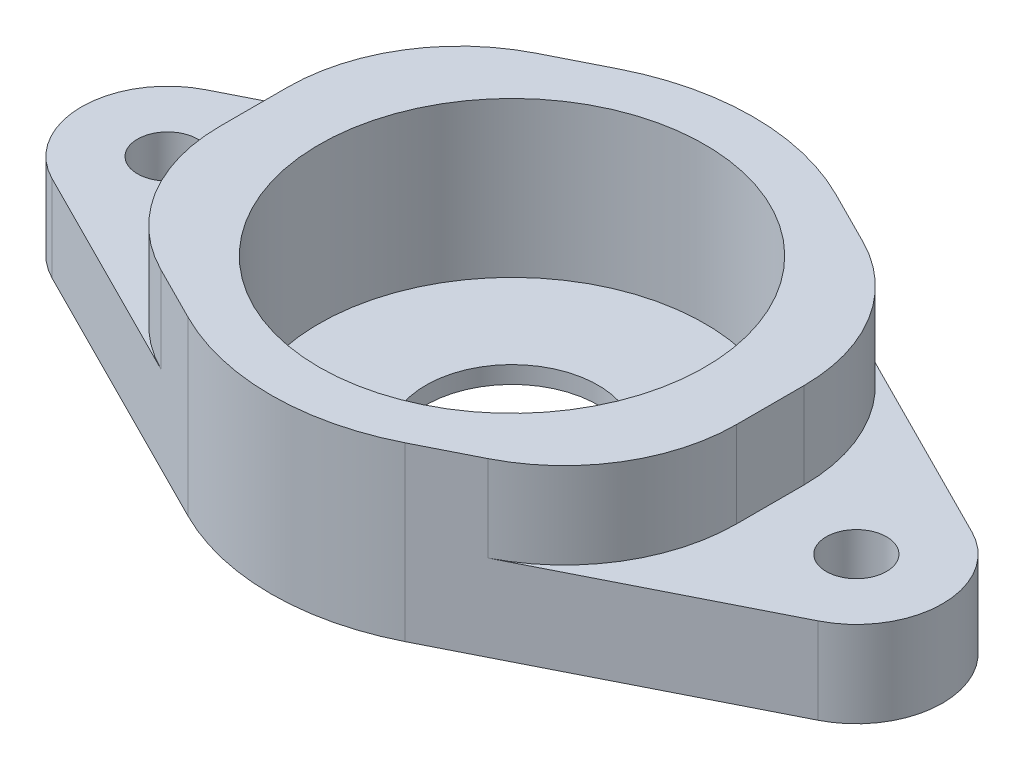
ISO-10303-21;
HEADER;
FILE_DESCRIPTION(('STEP AP214'),'2;1');
FILE_NAME('part.step','',(''),(''),'','','');
FILE_SCHEMA(('AUTOMOTIVE_DESIGN { 1 0 10303 214 1 1 1 1 }'));
ENDSEC;
DATA;
#1=APPLICATION_CONTEXT('core data for automotive mechanical design processes');
#2=APPLICATION_PROTOCOL_DEFINITION('international standard','automotive_design',2000,#1);
#3=PRODUCT_CONTEXT('',#1,'mechanical');
#4=PRODUCT('Part','Part','',(#3));
#5=PRODUCT_RELATED_PRODUCT_CATEGORY('part','',(#4));
#6=PRODUCT_DEFINITION_FORMATION('','',#4);
#7=PRODUCT_DEFINITION_CONTEXT('part definition',#1,'design');
#8=PRODUCT_DEFINITION('design','',#6,#7);
#9=PRODUCT_DEFINITION_SHAPE('','',#8);
#10=(LENGTH_UNIT() NAMED_UNIT(*) SI_UNIT(.MILLI.,.METRE.));
#11=(NAMED_UNIT(*) PLANE_ANGLE_UNIT() SI_UNIT($,.RADIAN.));
#12=(NAMED_UNIT(*) SI_UNIT($,.STERADIAN.) SOLID_ANGLE_UNIT());
#13=UNCERTAINTY_MEASURE_WITH_UNIT(LENGTH_MEASURE(1.E-05),#10,'distance_accuracy_value','');
#14=(GEOMETRIC_REPRESENTATION_CONTEXT(3) GLOBAL_UNCERTAINTY_ASSIGNED_CONTEXT((#13)) GLOBAL_UNIT_ASSIGNED_CONTEXT((#10,
#11,#12)) REPRESENTATION_CONTEXT('',''));
#15=CARTESIAN_POINT('',(0.,0.,0.));
#16=DIRECTION('',(0.,0.,1.));
#17=DIRECTION('',(1.,0.,0.));
#18=AXIS2_PLACEMENT_3D('',#15,#16,#17);
#19=CARTESIAN_POINT('',(-20.,10.,0.));
#20=DIRECTION('',(0.,1.,0.));
#21=DIRECTION('',(0.,0.,1.));
#22=AXIS2_PLACEMENT_3D('',#19,#20,#21);
#23=PLANE('',#22);
#24=DIRECTION('',(0.893028554974588,0.,-0.45));
#25=VECTOR('',#24,1.);
#26=CARTESIAN_POINT('',(6.3,10.,12.5023997696442));
#27=LINE('',#26,#25);
#28=CARTESIAN_POINT('',(6.3,10.,12.5023997696442));
#29=VERTEX_POINT('',#28);
#30=CARTESIAN_POINT('',(9.49999999999999,10.,10.8899093380914));
#31=VERTEX_POINT('',#30);
#32=EDGE_CURVE('E259',#29,#31,#27,.T.);
#33=ORIENTED_EDGE('',*,*,#32,.T.);
#34=CARTESIAN_POINT('',(4.99999999999999,10.,1.95962378834549));
#35=DIRECTION('',(0.,1.,0.));
#36=DIRECTION('',(0.,0.,1.));
#37=AXIS2_PLACEMENT_3D('',#34,#35,#36);
#38=CIRCLE('',#37,10.);
#39=CARTESIAN_POINT('',(15.,10.,1.95962378834549));
#40=VERTEX_POINT('',#39);
#41=EDGE_CURVE('E207',#31,#40,#38,.T.);
#42=ORIENTED_EDGE('',*,*,#41,.T.);
#43=DIRECTION('',(0.,0.,1.));
#44=VECTOR('',#43,1.);
#45=CARTESIAN_POINT('',(15.,10.,-14.));
#46=LINE('',#45,#44);
#47=CARTESIAN_POINT('',(15.,10.,-1.95962378834549));
#48=VERTEX_POINT('',#47);
#49=EDGE_CURVE('E246',#48,#40,#46,.T.);
#50=ORIENTED_EDGE('',*,*,#49,.F.);
#51=CARTESIAN_POINT('',(4.99999999999999,10.,-1.95962378834549));
#52=DIRECTION('',(0.,1.,0.));
#53=DIRECTION('',(0.,0.,1.));
#54=AXIS2_PLACEMENT_3D('',#51,#52,#53);
#55=CIRCLE('',#54,10.);
#56=CARTESIAN_POINT('',(9.49999999999999,10.,-10.8899093380914));
#57=VERTEX_POINT('',#56);
#58=EDGE_CURVE('E205',#48,#57,#55,.T.);
#59=ORIENTED_EDGE('',*,*,#58,.T.);
#60=DIRECTION('',(-0.893028554974588,0.,-0.45));
#61=VECTOR('',#60,1.);
#62=CARTESIAN_POINT('',(6.3,10.,-12.5023997696442));
#63=LINE('',#62,#61);
#64=CARTESIAN_POINT('',(6.3,10.,-12.5023997696442));
#65=VERTEX_POINT('',#64);
#66=EDGE_CURVE('E254',#57,#65,#63,.T.);
#67=ORIENTED_EDGE('',*,*,#66,.T.);
#68=CARTESIAN_POINT('',(0.,10.,0.));
#69=DIRECTION('',(0.,1.,0.));
#70=DIRECTION('',(0.,0.,1.));
#71=AXIS2_PLACEMENT_3D('',#68,#69,#70);
#72=CIRCLE('',#71,14.);
#73=CARTESIAN_POINT('',(-6.3,10.,-12.5023997696442));
#74=VERTEX_POINT('',#73);
#75=EDGE_CURVE('E173',#65,#74,#72,.T.);
#76=ORIENTED_EDGE('',*,*,#75,.T.);
#77=DIRECTION('',(-0.893028554974588,0.,0.45));
#78=VECTOR('',#77,1.);
#79=CARTESIAN_POINT('',(-22.25,10.,-4.46514277487293));
#80=LINE('',#79,#78);
#81=CARTESIAN_POINT('',(-9.5,10.,-10.8899093380914));
#82=VERTEX_POINT('',#81);
#83=EDGE_CURVE('E168',#74,#82,#80,.T.);
#84=ORIENTED_EDGE('',*,*,#83,.T.);
#85=CARTESIAN_POINT('',(-5.,10.,-1.95962378834549));
#86=DIRECTION('',(0.,1.,0.));
#87=DIRECTION('',(0.,0.,1.));
#88=AXIS2_PLACEMENT_3D('',#85,#86,#87);
#89=CIRCLE('',#88,10.);
#90=CARTESIAN_POINT('',(-15.,10.,-1.95962378834549));
#91=VERTEX_POINT('',#90);
#92=EDGE_CURVE('E203',#82,#91,#89,.T.);
#93=ORIENTED_EDGE('',*,*,#92,.T.);
#94=DIRECTION('',(0.,0.,1.));
#95=VECTOR('',#94,1.);
#96=CARTESIAN_POINT('',(-15.,10.,-14.));
#97=LINE('',#96,#95);
#98=CARTESIAN_POINT('',(-15.,10.,1.95962378834549));
#99=VERTEX_POINT('',#98);
#100=EDGE_CURVE('E308',#91,#99,#97,.T.);
#101=ORIENTED_EDGE('',*,*,#100,.T.);
#102=CARTESIAN_POINT('',(-5.,10.,1.95962378834549));
#103=DIRECTION('',(0.,1.,0.));
#104=DIRECTION('',(0.,0.,1.));
#105=AXIS2_PLACEMENT_3D('',#102,#103,#104);
#106=CIRCLE('',#105,10.);
#107=CARTESIAN_POINT('',(-9.5,10.,10.8899093380914));
#108=VERTEX_POINT('',#107);
#109=EDGE_CURVE('E201',#99,#108,#106,.T.);
#110=ORIENTED_EDGE('',*,*,#109,.T.);
#111=DIRECTION('',(0.893028554974588,0.,0.45));
#112=VECTOR('',#111,1.);
#113=CARTESIAN_POINT('',(-22.25,10.,4.46514277487294));
#114=LINE('',#113,#112);
#115=CARTESIAN_POINT('',(-6.3,10.,12.5023997696442));
#116=VERTEX_POINT('',#115);
#117=EDGE_CURVE('E284',#108,#116,#114,.T.);
#118=ORIENTED_EDGE('',*,*,#117,.T.);
#119=CARTESIAN_POINT('',(0.,10.,0.));
#120=DIRECTION('',(0.,1.,0.));
#121=DIRECTION('',(0.,0.,1.));
#122=AXIS2_PLACEMENT_3D('',#119,#120,#121);
#123=CIRCLE('',#122,14.);
#124=EDGE_CURVE('E262',#116,#29,#123,.T.);
#125=ORIENTED_EDGE('',*,*,#124,.T.);
#126=EDGE_LOOP('',(#33,#42,#50,#59,#67,#76,#84,#93,#101,#110,#118,#125));
#127=FACE_BOUND('',#126,.T.);
#128=CARTESIAN_POINT('',(0.,10.,0.));
#129=DIRECTION('',(0.,1.,0.));
#130=DIRECTION('',(0.,0.,1.));
#131=AXIS2_PLACEMENT_3D('',#128,#129,#130);
#132=CIRCLE('',#131,11.2);
#133=CARTESIAN_POINT('',(0.,10.,11.2));
#134=VERTEX_POINT('',#133);
#135=EDGE_CURVE('E295',#134,#134,#132,.T.);
#136=ORIENTED_EDGE('',*,*,#135,.F.);
#137=EDGE_LOOP('',(#136));
#138=FACE_BOUND('',#137,.T.);
#139=ADVANCED_FACE('F34',(#127,#138),#23,.T.);
#140=CARTESIAN_POINT('',(-20.,0.,0.));
#141=DIRECTION('',(0.,1.,0.));
#142=DIRECTION('',(0.,0.,1.));
#143=AXIS2_PLACEMENT_3D('',#140,#141,#142);
#144=PLANE('',#143);
#145=CARTESIAN_POINT('',(0.,0.,0.));
#146=DIRECTION('',(0.,1.,0.));
#147=DIRECTION('',(0.,0.,1.));
#148=AXIS2_PLACEMENT_3D('',#145,#146,#147);
#149=CIRCLE('',#148,5.);
#150=CARTESIAN_POINT('',(0.,0.,5.));
#151=VERTEX_POINT('',#150);
#152=EDGE_CURVE('E312',#151,#151,#149,.T.);
#153=ORIENTED_EDGE('',*,*,#152,.T.);
#154=EDGE_LOOP('',(#153));
#155=FACE_BOUND('',#154,.T.);
#156=CARTESIAN_POINT('',(-20.,0.,0.));
#157=DIRECTION('',(0.,1.,0.));
#158=DIRECTION('',(0.,0.,1.));
#159=AXIS2_PLACEMENT_3D('',#156,#157,#158);
#160=CIRCLE('',#159,5.);
#161=CARTESIAN_POINT('',(-22.25,0.,-4.46514277487293));
#162=VERTEX_POINT('',#161);
#163=CARTESIAN_POINT('',(-22.25,0.,4.46514277487294));
#164=VERTEX_POINT('',#163);
#165=EDGE_CURVE('E266',#162,#164,#160,.T.);
#166=ORIENTED_EDGE('',*,*,#165,.F.);
#167=DIRECTION('',(-0.893028554974588,0.,0.45));
#168=VECTOR('',#167,1.);
#169=CARTESIAN_POINT('',(-22.25,0.,-4.46514277487293));
#170=LINE('',#169,#168);
#171=CARTESIAN_POINT('',(-6.3,0.,-12.5023997696442));
#172=VERTEX_POINT('',#171);
#173=EDGE_CURVE('E165',#172,#162,#170,.T.);
#174=ORIENTED_EDGE('',*,*,#173,.F.);
#175=CARTESIAN_POINT('',(0.,0.,0.));
#176=DIRECTION('',(0.,1.,0.));
#177=DIRECTION('',(0.,0.,1.));
#178=AXIS2_PLACEMENT_3D('',#175,#176,#177);
#179=CIRCLE('',#178,14.);
#180=CARTESIAN_POINT('',(6.3,0.,-12.5023997696442));
#181=VERTEX_POINT('',#180);
#182=EDGE_CURVE('E280',#181,#172,#179,.T.);
#183=ORIENTED_EDGE('',*,*,#182,.F.);
#184=DIRECTION('',(-0.893028554974588,0.,-0.45));
#185=VECTOR('',#184,1.);
#186=CARTESIAN_POINT('',(6.3,0.,-12.5023997696442));
#187=LINE('',#186,#185);
#188=CARTESIAN_POINT('',(22.25,0.,-4.46514277487293));
#189=VERTEX_POINT('',#188);
#190=EDGE_CURVE('E279',#189,#181,#187,.T.);
#191=ORIENTED_EDGE('',*,*,#190,.F.);
#192=CARTESIAN_POINT('',(20.,0.,0.));
#193=DIRECTION('',(0.,1.,0.));
#194=DIRECTION('',(0.,0.,1.));
#195=AXIS2_PLACEMENT_3D('',#192,#193,#194);
#196=CIRCLE('',#195,5.);
#197=CARTESIAN_POINT('',(22.25,0.,4.46514277487293));
#198=VERTEX_POINT('',#197);
#199=EDGE_CURVE('E276',#198,#189,#196,.T.);
#200=ORIENTED_EDGE('',*,*,#199,.F.);
#201=DIRECTION('',(0.893028554974588,0.,-0.45));
#202=VECTOR('',#201,1.);
#203=CARTESIAN_POINT('',(6.3,0.,12.5023997696442));
#204=LINE('',#203,#202);
#205=CARTESIAN_POINT('',(6.3,0.,12.5023997696442));
#206=VERTEX_POINT('',#205);
#207=EDGE_CURVE('E273',#206,#198,#204,.T.);
#208=ORIENTED_EDGE('',*,*,#207,.F.);
#209=CARTESIAN_POINT('',(0.,0.,0.));
#210=DIRECTION('',(0.,1.,0.));
#211=DIRECTION('',(0.,0.,1.));
#212=AXIS2_PLACEMENT_3D('',#209,#210,#211);
#213=CIRCLE('',#212,14.);
#214=CARTESIAN_POINT('',(-6.3,0.,12.5023997696442));
#215=VERTEX_POINT('',#214);
#216=EDGE_CURVE('E271',#215,#206,#213,.T.);
#217=ORIENTED_EDGE('',*,*,#216,.F.);
#218=DIRECTION('',(0.893028554974588,0.,0.45));
#219=VECTOR('',#218,1.);
#220=CARTESIAN_POINT('',(-22.25,0.,4.46514277487294));
#221=LINE('',#220,#219);
#222=EDGE_CURVE('E268',#164,#215,#221,.T.);
#223=ORIENTED_EDGE('',*,*,#222,.F.);
#224=EDGE_LOOP('',(#166,#174,#183,#191,#200,#208,#217,#223));
#225=FACE_BOUND('',#224,.T.);
#226=CARTESIAN_POINT('',(20.,0.,0.));
#227=DIRECTION('',(0.,1.,0.));
#228=DIRECTION('',(0.,0.,1.));
#229=AXIS2_PLACEMENT_3D('',#226,#227,#228);
#230=CIRCLE('',#229,1.75);
#231=CARTESIAN_POINT('',(20.,0.,1.75));
#232=VERTEX_POINT('',#231);
#233=EDGE_CURVE('E269',#232,#232,#230,.T.);
#234=ORIENTED_EDGE('',*,*,#233,.T.);
#235=EDGE_LOOP('',(#234));
#236=FACE_BOUND('',#235,.T.);
#237=CARTESIAN_POINT('',(-20.,0.,0.));
#238=DIRECTION('',(0.,1.,0.));
#239=DIRECTION('',(0.,0.,1.));
#240=AXIS2_PLACEMENT_3D('',#237,#238,#239);
#241=CIRCLE('',#240,1.75);
#242=CARTESIAN_POINT('',(-20.,0.,1.75));
#243=VERTEX_POINT('',#242);
#244=EDGE_CURVE('E291',#243,#243,#241,.T.);
#245=ORIENTED_EDGE('',*,*,#244,.T.);
#246=EDGE_LOOP('',(#245));
#247=FACE_BOUND('',#246,.T.);
#248=ADVANCED_FACE('F336',(#155,#225,#236,#247),#144,.F.);
#249=CARTESIAN_POINT('',(-20.,10.,0.));
#250=DIRECTION('',(0.,-1.,0.));
#251=DIRECTION('',(0.,0.,-1.));
#252=AXIS2_PLACEMENT_3D('',#249,#250,#251);
#253=CYLINDRICAL_SURFACE('',#252,5.);
#254=DIRECTION('',(0.,-1.,0.));
#255=VECTOR('',#254,1.);
#256=CARTESIAN_POINT('',(-22.25,10.,4.46514277487294));
#257=LINE('',#256,#255);
#258=CARTESIAN_POINT('',(-22.25,5.,4.46514277487294));
#259=VERTEX_POINT('',#258);
#260=EDGE_CURVE('E151',#259,#164,#257,.T.);
#261=ORIENTED_EDGE('',*,*,#260,.F.);
#262=CARTESIAN_POINT('',(-20.,5.,0.));
#263=DIRECTION('',(0.,-1.,0.));
#264=DIRECTION('',(1.,0.,0.));
#265=AXIS2_PLACEMENT_3D('',#262,#263,#264);
#266=CIRCLE('',#265,5.);
#267=CARTESIAN_POINT('',(-22.25,5.,-4.46514277487293));
#268=VERTEX_POINT('',#267);
#269=EDGE_CURVE('E144',#259,#268,#266,.T.);
#270=ORIENTED_EDGE('',*,*,#269,.T.);
#271=DIRECTION('',(0.,-1.,0.));
#272=VECTOR('',#271,1.);
#273=CARTESIAN_POINT('',(-22.25,10.,-4.46514277487293));
#274=LINE('',#273,#272);
#275=EDGE_CURVE('E149',#268,#162,#274,.T.);
#276=ORIENTED_EDGE('',*,*,#275,.T.);
#277=ORIENTED_EDGE('',*,*,#165,.T.);
#278=EDGE_LOOP('',(#261,#270,#276,#277));
#279=FACE_BOUND('',#278,.T.);
#280=ADVANCED_FACE('F146',(#279),#253,.T.);
#281=CARTESIAN_POINT('',(-22.25,10.,4.46514277487294));
#282=DIRECTION('',(0.45,0.,-0.893028554974588));
#283=DIRECTION('',(-0.893028554974588,0.,-0.45));
#284=AXIS2_PLACEMENT_3D('',#281,#282,#283);
#285=PLANE('',#284);
#286=ORIENTED_EDGE('',*,*,#117,.F.);
#287=DIRECTION('',(0.,-1.,0.));
#288=VECTOR('',#287,1.);
#289=CARTESIAN_POINT('',(-9.5,10.,10.8899093380914));
#290=LINE('',#289,#288);
#291=CARTESIAN_POINT('',(-9.49999999999999,5.,10.8899093380914));
#292=VERTEX_POINT('',#291);
#293=EDGE_CURVE('E222',#108,#292,#290,.T.);
#294=ORIENTED_EDGE('',*,*,#293,.T.);
#295=DIRECTION('',(-0.893028554974588,0.,-0.45));
#296=VECTOR('',#295,1.);
#297=CARTESIAN_POINT('',(-22.25,5.,4.46514277487294));
#298=LINE('',#297,#296);
#299=EDGE_CURVE('E49',#292,#259,#298,.T.);
#300=ORIENTED_EDGE('',*,*,#299,.T.);
#301=ORIENTED_EDGE('',*,*,#260,.T.);
#302=ORIENTED_EDGE('',*,*,#222,.T.);
#303=DIRECTION('',(0.,-1.,0.));
#304=VECTOR('',#303,1.);
#305=CARTESIAN_POINT('',(-6.3,10.,12.5023997696442));
#306=LINE('',#305,#304);
#307=EDGE_CURVE('E187',#116,#215,#306,.T.);
#308=ORIENTED_EDGE('',*,*,#307,.F.);
#309=EDGE_LOOP('',(#286,#294,#300,#301,#302,#308));
#310=FACE_BOUND('',#309,.T.);
#311=ADVANCED_FACE('F364',(#310),#285,.F.);
#312=CARTESIAN_POINT('',(0.,10.,0.));
#313=DIRECTION('',(0.,-1.,0.));
#314=DIRECTION('',(0.,0.,-1.));
#315=AXIS2_PLACEMENT_3D('',#312,#313,#314);
#316=CYLINDRICAL_SURFACE('',#315,14.);
#317=ORIENTED_EDGE('',*,*,#216,.T.);
#318=DIRECTION('',(0.,-1.,0.));
#319=VECTOR('',#318,1.);
#320=CARTESIAN_POINT('',(6.3,10.,12.5023997696442));
#321=LINE('',#320,#319);
#322=EDGE_CURVE('E184',#29,#206,#321,.T.);
#323=ORIENTED_EDGE('',*,*,#322,.F.);
#324=ORIENTED_EDGE('',*,*,#124,.F.);
#325=ORIENTED_EDGE('',*,*,#307,.T.);
#326=EDGE_LOOP('',(#317,#323,#324,#325));
#327=FACE_BOUND('',#326,.T.);
#328=ADVANCED_FACE('F360',(#327),#316,.T.);
#329=CARTESIAN_POINT('',(6.3,10.,12.5023997696442));
#330=DIRECTION('',(-0.45,0.,-0.893028554974588));
#331=DIRECTION('',(-0.893028554974588,0.,0.45));
#332=AXIS2_PLACEMENT_3D('',#329,#330,#331);
#333=PLANE('',#332);
#334=DIRECTION('',(-0.893028554974588,0.,0.45));
#335=VECTOR('',#334,1.);
#336=CARTESIAN_POINT('',(6.3,5.,12.5023997696442));
#337=LINE('',#336,#335);
#338=CARTESIAN_POINT('',(22.25,5.,4.46514277487293));
#339=VERTEX_POINT('',#338);
#340=CARTESIAN_POINT('',(9.49999999999999,5.,10.8899093380914));
#341=VERTEX_POINT('',#340);
#342=EDGE_CURVE('E298',#339,#341,#337,.T.);
#343=ORIENTED_EDGE('',*,*,#342,.T.);
#344=DIRECTION('',(0.,1.,0.));
#345=VECTOR('',#344,1.);
#346=CARTESIAN_POINT('',(9.49999999999999,10.,10.8899093380914));
#347=LINE('',#346,#345);
#348=EDGE_CURVE('E191',#341,#31,#347,.T.);
#349=ORIENTED_EDGE('',*,*,#348,.T.);
#350=ORIENTED_EDGE('',*,*,#32,.F.);
#351=ORIENTED_EDGE('',*,*,#322,.T.);
#352=ORIENTED_EDGE('',*,*,#207,.T.);
#353=DIRECTION('',(0.,-1.,0.));
#354=VECTOR('',#353,1.);
#355=CARTESIAN_POINT('',(22.25,10.,4.46514277487293));
#356=LINE('',#355,#354);
#357=EDGE_CURVE('E182',#339,#198,#356,.T.);
#358=ORIENTED_EDGE('',*,*,#357,.F.);
#359=EDGE_LOOP('',(#343,#349,#350,#351,#352,#358));
#360=FACE_BOUND('',#359,.T.);
#361=ADVANCED_FACE('F356',(#360),#333,.F.);
#362=CARTESIAN_POINT('',(20.,10.,0.));
#363=DIRECTION('',(0.,-1.,0.));
#364=DIRECTION('',(0.,0.,-1.));
#365=AXIS2_PLACEMENT_3D('',#362,#363,#364);
#366=CYLINDRICAL_SURFACE('',#365,5.);
#367=DIRECTION('',(0.,-1.,0.));
#368=VECTOR('',#367,1.);
#369=CARTESIAN_POINT('',(22.25,10.,-4.46514277487293));
#370=LINE('',#369,#368);
#371=CARTESIAN_POINT('',(22.25,5.,-4.46514277487293));
#372=VERTEX_POINT('',#371);
#373=EDGE_CURVE('E180',#372,#189,#370,.T.);
#374=ORIENTED_EDGE('',*,*,#373,.F.);
#375=CARTESIAN_POINT('',(20.,5.,0.));
#376=DIRECTION('',(0.,-1.,0.));
#377=DIRECTION('',(0.,0.,-1.));
#378=AXIS2_PLACEMENT_3D('',#375,#376,#377);
#379=CIRCLE('',#378,5.);
#380=EDGE_CURVE('E302',#372,#339,#379,.T.);
#381=ORIENTED_EDGE('',*,*,#380,.T.);
#382=ORIENTED_EDGE('',*,*,#357,.T.);
#383=ORIENTED_EDGE('',*,*,#199,.T.);
#384=EDGE_LOOP('',(#374,#381,#382,#383));
#385=FACE_BOUND('',#384,.T.);
#386=ADVANCED_FACE('F353',(#385),#366,.T.);
#387=CARTESIAN_POINT('',(6.3,10.,-12.5023997696442));
#388=DIRECTION('',(-0.45,0.,0.893028554974588));
#389=DIRECTION('',(0.893028554974588,0.,0.45));
#390=AXIS2_PLACEMENT_3D('',#387,#388,#389);
#391=PLANE('',#390);
#392=ORIENTED_EDGE('',*,*,#66,.F.);
#393=DIRECTION('',(0.,-1.,0.));
#394=VECTOR('',#393,1.);
#395=CARTESIAN_POINT('',(9.49999999999999,10.,-10.8899093380914));
#396=LINE('',#395,#394);
#397=CARTESIAN_POINT('',(9.49999999999999,5.,-10.8899093380914));
#398=VERTEX_POINT('',#397);
#399=EDGE_CURVE('E213',#57,#398,#396,.T.);
#400=ORIENTED_EDGE('',*,*,#399,.T.);
#401=DIRECTION('',(0.893028554974588,0.,0.45));
#402=VECTOR('',#401,1.);
#403=CARTESIAN_POINT('',(6.3,5.,-12.5023997696442));
#404=LINE('',#403,#402);
#405=EDGE_CURVE('E198',#398,#372,#404,.T.);
#406=ORIENTED_EDGE('',*,*,#405,.T.);
#407=ORIENTED_EDGE('',*,*,#373,.T.);
#408=ORIENTED_EDGE('',*,*,#190,.T.);
#409=DIRECTION('',(0.,-1.,0.));
#410=VECTOR('',#409,1.);
#411=CARTESIAN_POINT('',(6.3,10.,-12.5023997696442));
#412=LINE('',#411,#410);
#413=EDGE_CURVE('E170',#65,#181,#412,.T.);
#414=ORIENTED_EDGE('',*,*,#413,.F.);
#415=EDGE_LOOP('',(#392,#400,#406,#407,#408,#414));
#416=FACE_BOUND('',#415,.T.);
#417=ADVANCED_FACE('F257',(#416),#391,.F.);
#418=CARTESIAN_POINT('',(0.,10.,0.));
#419=DIRECTION('',(0.,-1.,0.));
#420=DIRECTION('',(0.,0.,-1.));
#421=AXIS2_PLACEMENT_3D('',#418,#419,#420);
#422=CYLINDRICAL_SURFACE('',#421,14.);
#423=ORIENTED_EDGE('',*,*,#182,.T.);
#424=DIRECTION('',(0.,-1.,0.));
#425=VECTOR('',#424,1.);
#426=CARTESIAN_POINT('',(-6.3,10.,-12.5023997696442));
#427=LINE('',#426,#425);
#428=EDGE_CURVE('E167',#74,#172,#427,.T.);
#429=ORIENTED_EDGE('',*,*,#428,.F.);
#430=ORIENTED_EDGE('',*,*,#75,.F.);
#431=ORIENTED_EDGE('',*,*,#413,.T.);
#432=EDGE_LOOP('',(#423,#429,#430,#431));
#433=FACE_BOUND('',#432,.T.);
#434=ADVANCED_FACE('F348',(#433),#422,.T.);
#435=CARTESIAN_POINT('',(-22.25,10.,-4.46514277487293));
#436=DIRECTION('',(0.45,0.,0.893028554974588));
#437=DIRECTION('',(0.893028554974588,0.,-0.45));
#438=AXIS2_PLACEMENT_3D('',#435,#436,#437);
#439=PLANE('',#438);
#440=DIRECTION('',(0.893028554974588,0.,-0.45));
#441=VECTOR('',#440,1.);
#442=CARTESIAN_POINT('',(-22.25,5.,-4.46514277487293));
#443=LINE('',#442,#441);
#444=CARTESIAN_POINT('',(-9.5,5.,-10.8899093380914));
#445=VERTEX_POINT('',#444);
#446=EDGE_CURVE('E152',#268,#445,#443,.T.);
#447=ORIENTED_EDGE('',*,*,#446,.T.);
#448=DIRECTION('',(0.,1.,0.));
#449=VECTOR('',#448,1.);
#450=CARTESIAN_POINT('',(-9.5,10.,-10.8899093380914));
#451=LINE('',#450,#449);
#452=EDGE_CURVE('E216',#445,#82,#451,.T.);
#453=ORIENTED_EDGE('',*,*,#452,.T.);
#454=ORIENTED_EDGE('',*,*,#83,.F.);
#455=ORIENTED_EDGE('',*,*,#428,.T.);
#456=ORIENTED_EDGE('',*,*,#173,.T.);
#457=ORIENTED_EDGE('',*,*,#275,.F.);
#458=EDGE_LOOP('',(#447,#453,#454,#455,#456,#457));
#459=FACE_BOUND('',#458,.T.);
#460=ADVANCED_FACE('F162',(#459),#439,.F.);
#461=CARTESIAN_POINT('',(20.,10.,0.));
#462=DIRECTION('',(0.,-1.,0.));
#463=DIRECTION('',(0.,0.,-1.));
#464=AXIS2_PLACEMENT_3D('',#461,#462,#463);
#465=CYLINDRICAL_SURFACE('',#464,1.75);
#466=CARTESIAN_POINT('',(20.,5.,0.));
#467=DIRECTION('',(0.,-1.,0.));
#468=DIRECTION('',(0.,0.,-1.));
#469=AXIS2_PLACEMENT_3D('',#466,#467,#468);
#470=CIRCLE('',#469,1.75);
#471=CARTESIAN_POINT('',(20.,5.,-1.75));
#472=VERTEX_POINT('',#471);
#473=EDGE_CURVE('E195',#472,#472,#470,.T.);
#474=ORIENTED_EDGE('',*,*,#473,.F.);
#475=EDGE_LOOP('',(#474));
#476=FACE_BOUND('',#475,.T.);
#477=ORIENTED_EDGE('',*,*,#233,.F.);
#478=EDGE_LOOP('',(#477));
#479=FACE_BOUND('',#478,.T.);
#480=ADVANCED_FACE('F343',(#476,#479),#465,.F.);
#481=CARTESIAN_POINT('',(-20.,10.,0.));
#482=DIRECTION('',(0.,-1.,0.));
#483=DIRECTION('',(0.,0.,-1.));
#484=AXIS2_PLACEMENT_3D('',#481,#482,#483);
#485=CYLINDRICAL_SURFACE('',#484,1.75);
#486=CARTESIAN_POINT('',(-20.,5.,0.));
#487=DIRECTION('',(0.,-1.,0.));
#488=DIRECTION('',(1.,0.,0.));
#489=AXIS2_PLACEMENT_3D('',#486,#487,#488);
#490=CIRCLE('',#489,1.75);
#491=CARTESIAN_POINT('',(-18.25,5.,0.));
#492=VERTEX_POINT('',#491);
#493=EDGE_CURVE('E160',#492,#492,#490,.T.);
#494=ORIENTED_EDGE('',*,*,#493,.F.);
#495=EDGE_LOOP('',(#494));
#496=FACE_BOUND('',#495,.T.);
#497=ORIENTED_EDGE('',*,*,#244,.F.);
#498=EDGE_LOOP('',(#497));
#499=FACE_BOUND('',#498,.T.);
#500=ADVANCED_FACE('F332',(#496,#499),#485,.F.);
#501=CARTESIAN_POINT('',(0.,1.,0.));
#502=DIRECTION('',(0.,1.,0.));
#503=DIRECTION('',(0.,0.,1.));
#504=AXIS2_PLACEMENT_3D('',#501,#502,#503);
#505=CYLINDRICAL_SURFACE('',#504,11.2);
#506=CARTESIAN_POINT('',(0.,1.,0.));
#507=DIRECTION('',(0.,1.,0.));
#508=DIRECTION('',(0.,0.,1.));
#509=AXIS2_PLACEMENT_3D('',#506,#507,#508);
#510=CIRCLE('',#509,11.2);
#511=CARTESIAN_POINT('',(0.,1.,11.2));
#512=VERTEX_POINT('',#511);
#513=EDGE_CURVE('E294',#512,#512,#510,.T.);
#514=ORIENTED_EDGE('',*,*,#513,.F.);
#515=EDGE_LOOP('',(#514));
#516=FACE_BOUND('',#515,.T.);
#517=ORIENTED_EDGE('',*,*,#135,.T.);
#518=EDGE_LOOP('',(#517));
#519=FACE_BOUND('',#518,.T.);
#520=ADVANCED_FACE('F326',(#516,#519),#505,.F.);
#521=CARTESIAN_POINT('',(0.,1.,0.));
#522=DIRECTION('',(0.,1.,0.));
#523=DIRECTION('',(0.,0.,1.));
#524=AXIS2_PLACEMENT_3D('',#521,#522,#523);
#525=PLANE('',#524);
#526=CARTESIAN_POINT('',(0.,1.,0.));
#527=DIRECTION('',(0.,1.,0.));
#528=DIRECTION('',(0.,0.,1.));
#529=AXIS2_PLACEMENT_3D('',#526,#527,#528);
#530=CIRCLE('',#529,5.);
#531=CARTESIAN_POINT('',(0.,1.,5.));
#532=VERTEX_POINT('',#531);
#533=EDGE_CURVE('E38',#532,#532,#530,.T.);
#534=ORIENTED_EDGE('',*,*,#533,.F.);
#535=EDGE_LOOP('',(#534));
#536=FACE_BOUND('',#535,.T.);
#537=ORIENTED_EDGE('',*,*,#513,.T.);
#538=EDGE_LOOP('',(#537));
#539=FACE_BOUND('',#538,.T.);
#540=ADVANCED_FACE('F322',(#536,#539),#525,.T.);
#541=CARTESIAN_POINT('',(-15.,10.,-14.));
#542=DIRECTION('',(1.,0.,0.));
#543=DIRECTION('',(0.,0.,-1.));
#544=AXIS2_PLACEMENT_3D('',#541,#542,#543);
#545=PLANE('',#544);
#546=ORIENTED_EDGE('',*,*,#100,.F.);
#547=DIRECTION('',(0.,1.,0.));
#548=VECTOR('',#547,1.);
#549=CARTESIAN_POINT('',(-15.,10.,-1.95962378834549));
#550=LINE('',#549,#548);
#551=CARTESIAN_POINT('',(-15.,5.,-1.95962378834549));
#552=VERTEX_POINT('',#551);
#553=EDGE_CURVE('E220',#91,#552,#550,.F.);
#554=ORIENTED_EDGE('',*,*,#553,.T.);
#555=DIRECTION('',(0.,0.,1.));
#556=VECTOR('',#555,1.);
#557=CARTESIAN_POINT('',(-15.,5.,-14.));
#558=LINE('',#557,#556);
#559=CARTESIAN_POINT('',(-15.,5.,1.95962378834549));
#560=VERTEX_POINT('',#559);
#561=EDGE_CURVE('E194',#552,#560,#558,.T.);
#562=ORIENTED_EDGE('',*,*,#561,.T.);
#563=DIRECTION('',(0.,-1.,0.));
#564=VECTOR('',#563,1.);
#565=CARTESIAN_POINT('',(-15.,10.,1.95962378834549));
#566=LINE('',#565,#564);
#567=EDGE_CURVE('E218',#560,#99,#566,.F.);
#568=ORIENTED_EDGE('',*,*,#567,.T.);
#569=EDGE_LOOP('',(#546,#554,#562,#568));
#570=FACE_BOUND('',#569,.T.);
#571=ADVANCED_FACE('F325',(#570),#545,.F.);
#572=CARTESIAN_POINT('',(-15.,5.,-14.));
#573=DIRECTION('',(0.,-1.,0.));
#574=DIRECTION('',(1.,0.,0.));
#575=AXIS2_PLACEMENT_3D('',#572,#573,#574);
#576=PLANE('',#575);
#577=ORIENTED_EDGE('',*,*,#493,.T.);
#578=EDGE_LOOP('',(#577));
#579=FACE_BOUND('',#578,.T.);
#580=ORIENTED_EDGE('',*,*,#561,.F.);
#581=CARTESIAN_POINT('',(-5.,5.,-1.95962378834549));
#582=DIRECTION('',(0.,-1.,0.));
#583=DIRECTION('',(1.,0.,0.));
#584=AXIS2_PLACEMENT_3D('',#581,#582,#583);
#585=CIRCLE('',#584,10.);
#586=EDGE_CURVE('E43',#552,#445,#585,.T.);
#587=ORIENTED_EDGE('',*,*,#586,.T.);
#588=ORIENTED_EDGE('',*,*,#446,.F.);
#589=ORIENTED_EDGE('',*,*,#269,.F.);
#590=ORIENTED_EDGE('',*,*,#299,.F.);
#591=CARTESIAN_POINT('',(-5.,5.,1.95962378834549));
#592=DIRECTION('',(0.,-1.,0.));
#593=DIRECTION('',(1.,0.,0.));
#594=AXIS2_PLACEMENT_3D('',#591,#592,#593);
#595=CIRCLE('',#594,10.);
#596=EDGE_CURVE('E11',#292,#560,#595,.T.);
#597=ORIENTED_EDGE('',*,*,#596,.T.);
#598=EDGE_LOOP('',(#580,#587,#588,#589,#590,#597));
#599=FACE_BOUND('',#598,.T.);
#600=ADVANCED_FACE('F155',(#579,#599),#576,.F.);
#601=CARTESIAN_POINT('',(15.,10.,-14.));
#602=DIRECTION('',(-1.,0.,0.));
#603=DIRECTION('',(0.,0.,1.));
#604=AXIS2_PLACEMENT_3D('',#601,#602,#603);
#605=PLANE('',#604);
#606=ORIENTED_EDGE('',*,*,#49,.T.);
#607=DIRECTION('',(0.,1.,0.));
#608=VECTOR('',#607,1.);
#609=CARTESIAN_POINT('',(15.,10.,1.95962378834549));
#610=LINE('',#609,#608);
#611=CARTESIAN_POINT('',(15.,5.,1.95962378834549));
#612=VERTEX_POINT('',#611);
#613=EDGE_CURVE('E211',#40,#612,#610,.F.);
#614=ORIENTED_EDGE('',*,*,#613,.T.);
#615=DIRECTION('',(0.,0.,1.));
#616=VECTOR('',#615,1.);
#617=CARTESIAN_POINT('',(15.,5.,-14.));
#618=LINE('',#617,#616);
#619=CARTESIAN_POINT('',(15.,5.,-1.95962378834549));
#620=VERTEX_POINT('',#619);
#621=EDGE_CURVE('E235',#620,#612,#618,.T.);
#622=ORIENTED_EDGE('',*,*,#621,.F.);
#623=DIRECTION('',(0.,-1.,0.));
#624=VECTOR('',#623,1.);
#625=CARTESIAN_POINT('',(15.,10.,-1.95962378834549));
#626=LINE('',#625,#624);
#627=EDGE_CURVE('E209',#620,#48,#626,.F.);
#628=ORIENTED_EDGE('',*,*,#627,.T.);
#629=EDGE_LOOP('',(#606,#614,#622,#628));
#630=FACE_BOUND('',#629,.T.);
#631=ADVANCED_FACE('F243',(#630),#605,.F.);
#632=CARTESIAN_POINT('',(15.,5.,-14.));
#633=DIRECTION('',(0.,-1.,0.));
#634=DIRECTION('',(0.,0.,-1.));
#635=AXIS2_PLACEMENT_3D('',#632,#633,#634);
#636=PLANE('',#635);
#637=ORIENTED_EDGE('',*,*,#473,.T.);
#638=EDGE_LOOP('',(#637));
#639=FACE_BOUND('',#638,.T.);
#640=ORIENTED_EDGE('',*,*,#380,.F.);
#641=ORIENTED_EDGE('',*,*,#405,.F.);
#642=CARTESIAN_POINT('',(4.99999999999999,5.,-1.95962378834549));
#643=DIRECTION('',(0.,-1.,0.));
#644=DIRECTION('',(0.,0.,-1.));
#645=AXIS2_PLACEMENT_3D('',#642,#643,#644);
#646=CIRCLE('',#645,10.);
#647=EDGE_CURVE('E228',#398,#620,#646,.T.);
#648=ORIENTED_EDGE('',*,*,#647,.T.);
#649=ORIENTED_EDGE('',*,*,#621,.T.);
#650=CARTESIAN_POINT('',(4.99999999999999,5.,1.95962378834549));
#651=DIRECTION('',(0.,-1.,0.));
#652=DIRECTION('',(0.,0.,-1.));
#653=AXIS2_PLACEMENT_3D('',#650,#651,#652);
#654=CIRCLE('',#653,10.);
#655=EDGE_CURVE('E225',#612,#341,#654,.T.);
#656=ORIENTED_EDGE('',*,*,#655,.T.);
#657=ORIENTED_EDGE('',*,*,#342,.F.);
#658=EDGE_LOOP('',(#640,#641,#648,#649,#656,#657));
#659=FACE_BOUND('',#658,.T.);
#660=ADVANCED_FACE('F234',(#639,#659),#636,.F.);
#661=CARTESIAN_POINT('',(4.99999999999999,10.,1.95962378834549));
#662=DIRECTION('',(0.,1.,0.));
#663=DIRECTION('',(0.,0.,1.));
#664=AXIS2_PLACEMENT_3D('',#661,#662,#663);
#665=CYLINDRICAL_SURFACE('',#664,10.);
#666=ORIENTED_EDGE('',*,*,#655,.F.);
#667=ORIENTED_EDGE('',*,*,#613,.F.);
#668=ORIENTED_EDGE('',*,*,#41,.F.);
#669=ORIENTED_EDGE('',*,*,#348,.F.);
#670=EDGE_LOOP('',(#666,#667,#668,#669));
#671=FACE_BOUND('',#670,.T.);
#672=ADVANCED_FACE('F371',(#671),#665,.T.);
#673=CARTESIAN_POINT('',(4.99999999999999,10.,-1.95962378834549));
#674=DIRECTION('',(0.,-1.,0.));
#675=DIRECTION('',(0.,0.,-1.));
#676=AXIS2_PLACEMENT_3D('',#673,#674,#675);
#677=CYLINDRICAL_SURFACE('',#676,10.);
#678=ORIENTED_EDGE('',*,*,#58,.F.);
#679=ORIENTED_EDGE('',*,*,#627,.F.);
#680=ORIENTED_EDGE('',*,*,#647,.F.);
#681=ORIENTED_EDGE('',*,*,#399,.F.);
#682=EDGE_LOOP('',(#678,#679,#680,#681));
#683=FACE_BOUND('',#682,.T.);
#684=ADVANCED_FACE('F249',(#683),#677,.T.);
#685=CARTESIAN_POINT('',(-5.,10.,-1.95962378834549));
#686=DIRECTION('',(0.,1.,0.));
#687=DIRECTION('',(0.,0.,1.));
#688=AXIS2_PLACEMENT_3D('',#685,#686,#687);
#689=CYLINDRICAL_SURFACE('',#688,10.);
#690=ORIENTED_EDGE('',*,*,#586,.F.);
#691=ORIENTED_EDGE('',*,*,#553,.F.);
#692=ORIENTED_EDGE('',*,*,#92,.F.);
#693=ORIENTED_EDGE('',*,*,#452,.F.);
#694=EDGE_LOOP('',(#690,#691,#692,#693));
#695=FACE_BOUND('',#694,.T.);
#696=ADVANCED_FACE('F376',(#695),#689,.T.);
#697=CARTESIAN_POINT('',(-5.,10.,1.95962378834549));
#698=DIRECTION('',(0.,-1.,0.));
#699=DIRECTION('',(0.,0.,-1.));
#700=AXIS2_PLACEMENT_3D('',#697,#698,#699);
#701=CYLINDRICAL_SURFACE('',#700,10.);
#702=ORIENTED_EDGE('',*,*,#109,.F.);
#703=ORIENTED_EDGE('',*,*,#567,.F.);
#704=ORIENTED_EDGE('',*,*,#596,.F.);
#705=ORIENTED_EDGE('',*,*,#293,.F.);
#706=EDGE_LOOP('',(#702,#703,#704,#705));
#707=FACE_BOUND('',#706,.T.);
#708=ADVANCED_FACE('F36',(#707),#701,.T.);
#709=CARTESIAN_POINT('',(0.,0.,0.));
#710=DIRECTION('',(0.,1.,0.));
#711=DIRECTION('',(0.,0.,1.));
#712=AXIS2_PLACEMENT_3D('',#709,#710,#711);
#713=CYLINDRICAL_SURFACE('',#712,5.);
#714=ORIENTED_EDGE('',*,*,#533,.T.);
#715=EDGE_LOOP('',(#714));
#716=FACE_BOUND('',#715,.T.);
#717=ORIENTED_EDGE('',*,*,#152,.F.);
#718=EDGE_LOOP('',(#717));
#719=FACE_BOUND('',#718,.T.);
#720=ADVANCED_FACE('F319',(#716,#719),#713,.F.);
#721=CLOSED_SHELL('',(#139,#248,#280,#311,#328,#361,#386,#417,#434,#460,#480,#500,#520,#540,
#571,#600,#631,#660,#672,#684,#696,#708,#720));
#722=MANIFOLD_SOLID_BREP('B2',#721);
#723=ADVANCED_BREP_SHAPE_REPRESENTATION('',(#18,#722),#14);
#724=SHAPE_DEFINITION_REPRESENTATION(#9,#723);
ENDSEC;
END-ISO-10303-21;
